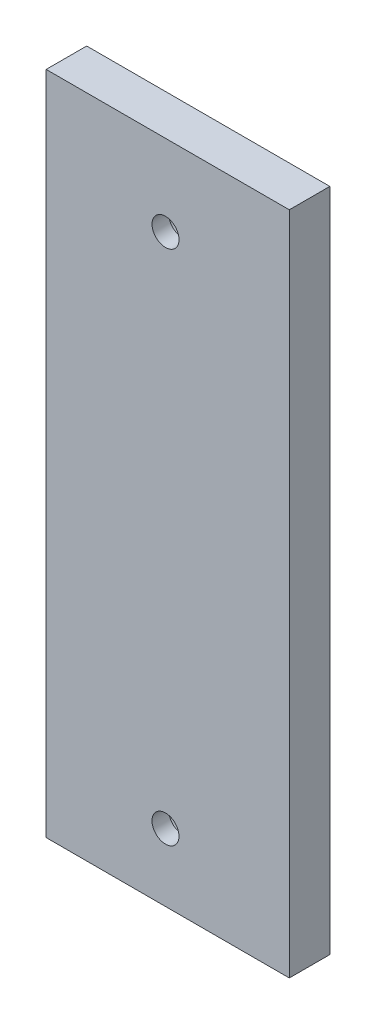
ISO-10303-21;
HEADER;
FILE_DESCRIPTION(('STEP AP214'),'2;1');
FILE_NAME('part.step','',(''),(''),'','','');
FILE_SCHEMA(('AUTOMOTIVE_DESIGN { 1 0 10303 214 1 1 1 1 }'));
ENDSEC;
DATA;
#1=APPLICATION_CONTEXT('core data for automotive mechanical design processes');
#2=APPLICATION_PROTOCOL_DEFINITION('international standard','automotive_design',2000,#1);
#3=PRODUCT_CONTEXT('',#1,'mechanical');
#4=PRODUCT('Part','Part','',(#3));
#5=PRODUCT_RELATED_PRODUCT_CATEGORY('part','',(#4));
#6=PRODUCT_DEFINITION_FORMATION('','',#4);
#7=PRODUCT_DEFINITION_CONTEXT('part definition',#1,'design');
#8=PRODUCT_DEFINITION('design','',#6,#7);
#9=PRODUCT_DEFINITION_SHAPE('','',#8);
#10=(LENGTH_UNIT() NAMED_UNIT(*) SI_UNIT(.MILLI.,.METRE.));
#11=(NAMED_UNIT(*) PLANE_ANGLE_UNIT() SI_UNIT($,.RADIAN.));
#12=(NAMED_UNIT(*) SI_UNIT($,.STERADIAN.) SOLID_ANGLE_UNIT());
#13=UNCERTAINTY_MEASURE_WITH_UNIT(LENGTH_MEASURE(1.E-05),#10,'distance_accuracy_value','');
#14=(GEOMETRIC_REPRESENTATION_CONTEXT(3) GLOBAL_UNCERTAINTY_ASSIGNED_CONTEXT((#13)) GLOBAL_UNIT_ASSIGNED_CONTEXT((#10,
#11,#12)) REPRESENTATION_CONTEXT('',''));
#15=CARTESIAN_POINT('',(0.,0.,0.));
#16=DIRECTION('',(0.,0.,1.));
#17=DIRECTION('',(1.,0.,0.));
#18=AXIS2_PLACEMENT_3D('',#15,#16,#17);
#19=CARTESIAN_POINT('',(0.,-76.5,-6.));
#20=DIRECTION('',(0.,0.,1.));
#21=DIRECTION('',(1.,0.,0.));
#22=AXIS2_PLACEMENT_3D('',#19,#20,#21);
#23=CYLINDRICAL_SURFACE('',#22,2.);
#24=CARTESIAN_POINT('',(0.,-76.5,6.));
#25=DIRECTION('',(0.,0.,1.));
#26=DIRECTION('',(1.,0.,0.));
#27=AXIS2_PLACEMENT_3D('',#24,#25,#26);
#28=CIRCLE('',#27,2.);
#29=CARTESIAN_POINT('',(2.,-76.5,6.));
#30=VERTEX_POINT('',#29);
#31=EDGE_CURVE('E173',#30,#30,#28,.T.);
#32=ORIENTED_EDGE('',*,*,#31,.T.);
#33=EDGE_LOOP('',(#32));
#34=FACE_BOUND('',#33,.T.);
#35=CARTESIAN_POINT('',(0.,-76.5,3.5));
#36=DIRECTION('',(0.,0.,-1.));
#37=DIRECTION('',(-1.,0.,0.));
#38=AXIS2_PLACEMENT_3D('',#35,#36,#37);
#39=CIRCLE('',#38,2.);
#40=CARTESIAN_POINT('',(-2.,-76.5,3.5));
#41=VERTEX_POINT('',#40);
#42=EDGE_CURVE('E270',#41,#41,#39,.F.);
#43=ORIENTED_EDGE('',*,*,#42,.F.);
#44=EDGE_LOOP('',(#43));
#45=FACE_BOUND('',#44,.T.);
#46=ADVANCED_FACE('F75',(#34,#45),#23,.F.);
#47=CARTESIAN_POINT('',(0.,0.,-6.));
#48=DIRECTION('',(0.,0.,1.));
#49=DIRECTION('',(1.,0.,0.));
#50=AXIS2_PLACEMENT_3D('',#47,#48,#49);
#51=CYLINDRICAL_SURFACE('',#50,2.);
#52=CARTESIAN_POINT('',(0.,0.,6.));
#53=DIRECTION('',(0.,0.,1.));
#54=DIRECTION('',(1.,0.,0.));
#55=AXIS2_PLACEMENT_3D('',#52,#53,#54);
#56=CIRCLE('',#55,2.);
#57=CARTESIAN_POINT('',(2.,0.,6.));
#58=VERTEX_POINT('',#57);
#59=EDGE_CURVE('E266',#58,#58,#56,.T.);
#60=ORIENTED_EDGE('',*,*,#59,.T.);
#61=EDGE_LOOP('',(#60));
#62=FACE_BOUND('',#61,.T.);
#63=CARTESIAN_POINT('',(0.,0.,3.5));
#64=DIRECTION('',(0.,0.,-1.));
#65=DIRECTION('',(-1.,0.,0.));
#66=AXIS2_PLACEMENT_3D('',#63,#64,#65);
#67=CIRCLE('',#66,2.);
#68=CARTESIAN_POINT('',(-2.,0.,3.5));
#69=VERTEX_POINT('',#68);
#70=EDGE_CURVE('E259',#69,#69,#67,.F.);
#71=ORIENTED_EDGE('',*,*,#70,.F.);
#72=EDGE_LOOP('',(#71));
#73=FACE_BOUND('',#72,.T.);
#74=ADVANCED_FACE('F326',(#62,#73),#51,.F.);
#75=CARTESIAN_POINT('',(-19.6697568376902,-86.5,4.));
#76=DIRECTION('',(0.,1.,0.));
#77=DIRECTION('',(0.,0.,1.));
#78=AXIS2_PLACEMENT_3D('',#75,#76,#77);
#79=PLANE('',#78);
#80=DIRECTION('',(1.,0.,0.));
#81=VECTOR('',#80,1.);
#82=CARTESIAN_POINT('',(-19.6697568376902,-86.5,0.));
#83=LINE('',#82,#81);
#84=CARTESIAN_POINT('',(-17.6697568376902,-86.5,0.));
#85=VERTEX_POINT('',#84);
#86=CARTESIAN_POINT('',(-10.8633723894514,-86.5,0.));
#87=VERTEX_POINT('',#86);
#88=EDGE_CURVE('E12',#85,#87,#83,.T.);
#89=ORIENTED_EDGE('',*,*,#88,.T.);
#90=DIRECTION('',(-0.34202013946712,0.,0.939692622190305));
#91=VECTOR('',#90,1.);
#92=CARTESIAN_POINT('',(-13.1790988618468,-86.5,6.362406273827));
#93=LINE('',#92,#91);
#94=CARTESIAN_POINT('',(-12.3920473538388,-86.5,4.2));
#95=VERTEX_POINT('',#94);
#96=EDGE_CURVE('E252',#87,#95,#93,.T.);
#97=ORIENTED_EDGE('',*,*,#96,.T.);
#98=DIRECTION('',(1.,0.,0.));
#99=VECTOR('',#98,1.);
#100=CARTESIAN_POINT('',(-19.6697568376902,-86.5,4.20000000000006));
#101=LINE('',#100,#99);
#102=CARTESIAN_POINT('',(-11.7757358965809,-86.5,4.2));
#103=VERTEX_POINT('',#102);
#104=EDGE_CURVE('E243',#95,#103,#101,.T.);
#105=ORIENTED_EDGE('',*,*,#104,.T.);
#106=DIRECTION('',(0.707106781186548,0.,-0.707106781186548));
#107=VECTOR('',#106,1.);
#108=CARTESIAN_POINT('',(-15.6227463671356,-86.5,8.04701047055465));
#109=LINE('',#108,#107);
#110=CARTESIAN_POINT('',(-7.57573589658091,-86.5,0.));
#111=VERTEX_POINT('',#110);
#112=EDGE_CURVE('E246',#103,#111,#109,.T.);
#113=ORIENTED_EDGE('',*,*,#112,.T.);
#114=CARTESIAN_POINT('',(7.57573704490984,-86.5,0.));
#115=VERTEX_POINT('',#114);
#116=EDGE_CURVE('E83',#111,#115,#83,.T.);
#117=ORIENTED_EDGE('',*,*,#116,.T.);
#118=DIRECTION('',(0.707106831438041,0.,0.707106730935051));
#119=VECTOR('',#118,1.);
#120=CARTESIAN_POINT('',(-4.04701183262788,-86.5,-11.6227472255653));
#121=LINE('',#120,#119);
#122=CARTESIAN_POINT('',(11.7757376418672,-86.5,4.2));
#123=VERTEX_POINT('',#122);
#124=EDGE_CURVE('E237',#115,#123,#121,.T.);
#125=ORIENTED_EDGE('',*,*,#124,.T.);
#126=DIRECTION('',(1.,0.,0.));
#127=VECTOR('',#126,1.);
#128=CARTESIAN_POINT('',(-19.6697568376902,-86.5,4.20000000000013));
#129=LINE('',#128,#127);
#130=CARTESIAN_POINT('',(12.3920482223146,-86.5,4.2));
#131=VERTEX_POINT('',#130);
#132=EDGE_CURVE('E214',#123,#131,#129,.T.);
#133=ORIENTED_EDGE('',*,*,#132,.T.);
#134=DIRECTION('',(-0.342020209845369,0.,-0.939692596574715));
#135=VECTOR('',#134,1.);
#136=CARTESIAN_POINT('',(8.57724926290699,-86.5,-6.28107169221646));
#137=LINE('',#136,#135);
#138=CARTESIAN_POINT('',(10.8633729016973,-86.5,0.));
#139=VERTEX_POINT('',#138);
#140=EDGE_CURVE('E235',#131,#139,#137,.T.);
#141=ORIENTED_EDGE('',*,*,#140,.T.);
#142=CARTESIAN_POINT('',(18.3302431623098,-86.5,0.));
#143=VERTEX_POINT('',#142);
#144=EDGE_CURVE('E84',#139,#143,#83,.T.);
#145=ORIENTED_EDGE('',*,*,#144,.T.);
#146=DIRECTION('',(0.,0.,1.));
#147=VECTOR('',#146,1.);
#148=CARTESIAN_POINT('',(18.3302431623098,-86.5,-6.));
#149=LINE('',#148,#147);
#150=CARTESIAN_POINT('',(18.3302431623098,-86.5,6.));
#151=VERTEX_POINT('',#150);
#152=EDGE_CURVE('E283',#143,#151,#149,.T.);
#153=ORIENTED_EDGE('',*,*,#152,.T.);
#154=DIRECTION('',(1.,0.,0.));
#155=VECTOR('',#154,1.);
#156=CARTESIAN_POINT('',(-17.6697568376902,-86.5,6.));
#157=LINE('',#156,#155);
#158=CARTESIAN_POINT('',(-17.6697568376902,-86.5,6.));
#159=VERTEX_POINT('',#158);
#160=EDGE_CURVE('E172',#159,#151,#157,.T.);
#161=ORIENTED_EDGE('',*,*,#160,.F.);
#162=DIRECTION('',(0.,0.,1.));
#163=VECTOR('',#162,1.);
#164=CARTESIAN_POINT('',(-17.6697568376902,-86.5,-6.));
#165=LINE('',#164,#163);
#166=EDGE_CURVE('E168',#85,#159,#165,.T.);
#167=ORIENTED_EDGE('',*,*,#166,.F.);
#168=EDGE_LOOP('',(#89,#97,#105,#113,#117,#125,#133,#141,#145,#153,#161,#167));
#169=FACE_BOUND('',#168,.T.);
#170=ADVANCED_FACE('F77',(#169),#79,.F.);
#171=CARTESIAN_POINT('',(0.,0.,0.));
#172=DIRECTION('',(0.,0.,1.));
#173=DIRECTION('',(1.,0.,0.));
#174=AXIS2_PLACEMENT_3D('',#171,#172,#173);
#175=PLANE('',#174);
#176=ORIENTED_EDGE('',*,*,#144,.F.);
#177=DIRECTION('',(0.,1.,0.));
#178=VECTOR('',#177,1.);
#179=CARTESIAN_POINT('',(10.8633729016973,0.,0.));
#180=LINE('',#179,#178);
#181=CARTESIAN_POINT('',(10.8633729016973,10.,0.));
#182=VERTEX_POINT('',#181);
#183=EDGE_CURVE('E232',#139,#182,#180,.T.);
#184=ORIENTED_EDGE('',*,*,#183,.T.);
#185=DIRECTION('',(-1.,0.,0.));
#186=VECTOR('',#185,1.);
#187=CARTESIAN_POINT('',(-17.6697568376902,10.,0.));
#188=LINE('',#187,#186);
#189=CARTESIAN_POINT('',(7.57573704490984,10.,0.));
#190=VERTEX_POINT('',#189);
#191=EDGE_CURVE('E190',#182,#190,#188,.T.);
#192=ORIENTED_EDGE('',*,*,#191,.T.);
#193=DIRECTION('',(0.,-1.,0.));
#194=VECTOR('',#193,1.);
#195=CARTESIAN_POINT('',(7.57573704490984,0.,0.));
#196=LINE('',#195,#194);
#197=EDGE_CURVE('E240',#190,#115,#196,.T.);
#198=ORIENTED_EDGE('',*,*,#197,.T.);
#199=ORIENTED_EDGE('',*,*,#116,.F.);
#200=DIRECTION('',(0.,1.,0.));
#201=VECTOR('',#200,1.);
#202=CARTESIAN_POINT('',(-7.57573589658091,0.,0.));
#203=LINE('',#202,#201);
#204=CARTESIAN_POINT('',(-7.57573589658092,10.,0.));
#205=VERTEX_POINT('',#204);
#206=EDGE_CURVE('E249',#111,#205,#203,.T.);
#207=ORIENTED_EDGE('',*,*,#206,.T.);
#208=CARTESIAN_POINT('',(-10.8633723894514,10.,0.));
#209=VERTEX_POINT('',#208);
#210=EDGE_CURVE('E193',#205,#209,#188,.T.);
#211=ORIENTED_EDGE('',*,*,#210,.T.);
#212=DIRECTION('',(0.,-1.,0.));
#213=VECTOR('',#212,1.);
#214=CARTESIAN_POINT('',(-10.8633723894514,0.,0.));
#215=LINE('',#214,#213);
#216=EDGE_CURVE('E255',#209,#87,#215,.T.);
#217=ORIENTED_EDGE('',*,*,#216,.T.);
#218=ORIENTED_EDGE('',*,*,#88,.F.);
#219=DIRECTION('',(0.,1.,0.));
#220=VECTOR('',#219,1.);
#221=CARTESIAN_POINT('',(-17.6697568376902,0.,0.));
#222=LINE('',#221,#220);
#223=CARTESIAN_POINT('',(-17.6697568376902,12.,0.));
#224=VERTEX_POINT('',#223);
#225=EDGE_CURVE('E91',#85,#224,#222,.T.);
#226=ORIENTED_EDGE('',*,*,#225,.T.);
#227=DIRECTION('',(-1.,0.,0.));
#228=VECTOR('',#227,1.);
#229=CARTESIAN_POINT('',(-17.6697568376902,12.,0.));
#230=LINE('',#229,#228);
#231=CARTESIAN_POINT('',(18.3302431623098,12.,0.));
#232=VERTEX_POINT('',#231);
#233=EDGE_CURVE('E189',#232,#224,#230,.T.);
#234=ORIENTED_EDGE('',*,*,#233,.F.);
#235=DIRECTION('',(0.,-1.,0.));
#236=VECTOR('',#235,1.);
#237=CARTESIAN_POINT('',(18.3302431623098,0.,0.));
#238=LINE('',#237,#236);
#239=EDGE_CURVE('E285',#232,#143,#238,.T.);
#240=ORIENTED_EDGE('',*,*,#239,.T.);
#241=EDGE_LOOP('',(#176,#184,#192,#198,#199,#207,#211,#217,#218,#226,#234,#240));
#242=FACE_BOUND('',#241,.T.);
#243=CARTESIAN_POINT('',(0.,0.,0.));
#244=DIRECTION('',(0.,0.,-1.));
#245=DIRECTION('',(-1.,0.,0.));
#246=AXIS2_PLACEMENT_3D('',#243,#244,#245);
#247=CIRCLE('',#246,4.25);
#248=CARTESIAN_POINT('',(-4.25,0.,0.));
#249=VERTEX_POINT('',#248);
#250=EDGE_CURVE('E263',#249,#249,#247,.T.);
#251=ORIENTED_EDGE('',*,*,#250,.F.);
#252=EDGE_LOOP('',(#251));
#253=FACE_BOUND('',#252,.T.);
#254=CARTESIAN_POINT('',(0.,-76.5,0.));
#255=DIRECTION('',(0.,0.,-1.));
#256=DIRECTION('',(-1.,0.,0.));
#257=AXIS2_PLACEMENT_3D('',#254,#255,#256);
#258=CIRCLE('',#257,4.25);
#259=CARTESIAN_POINT('',(-4.25,-76.5,0.));
#260=VERTEX_POINT('',#259);
#261=EDGE_CURVE('E258',#260,#260,#258,.T.);
#262=ORIENTED_EDGE('',*,*,#261,.F.);
#263=EDGE_LOOP('',(#262));
#264=FACE_BOUND('',#263,.T.);
#265=ADVANCED_FACE('F292',(#242,#253,#264),#175,.F.);
#266=CARTESIAN_POINT('',(18.3302431623098,10.,-6.));
#267=DIRECTION('',(-1.,0.,0.));
#268=DIRECTION('',(0.,-1.,0.));
#269=AXIS2_PLACEMENT_3D('',#266,#267,#268);
#270=PLANE('',#269);
#271=ORIENTED_EDGE('',*,*,#239,.F.);
#272=DIRECTION('',(0.,0.,-1.));
#273=VECTOR('',#272,1.);
#274=CARTESIAN_POINT('',(18.3302431623098,12.,0.));
#275=LINE('',#274,#273);
#276=CARTESIAN_POINT('',(18.3302431623098,12.,6.));
#277=VERTEX_POINT('',#276);
#278=EDGE_CURVE('E184',#277,#232,#275,.T.);
#279=ORIENTED_EDGE('',*,*,#278,.F.);
#280=DIRECTION('',(0.,1.,0.));
#281=VECTOR('',#280,1.);
#282=CARTESIAN_POINT('',(18.3302431623098,10.,6.));
#283=LINE('',#282,#281);
#284=EDGE_CURVE('E180',#151,#277,#283,.T.);
#285=ORIENTED_EDGE('',*,*,#284,.F.);
#286=ORIENTED_EDGE('',*,*,#152,.F.);
#287=EDGE_LOOP('',(#271,#279,#285,#286));
#288=FACE_BOUND('',#287,.T.);
#289=ADVANCED_FACE('F303',(#288),#270,.F.);
#290=CARTESIAN_POINT('',(-17.6697568376902,-86.5,-6.));
#291=DIRECTION('',(1.,0.,0.));
#292=DIRECTION('',(0.,0.,-1.));
#293=AXIS2_PLACEMENT_3D('',#290,#291,#292);
#294=PLANE('',#293);
#295=ORIENTED_EDGE('',*,*,#166,.T.);
#296=DIRECTION('',(0.,-1.,0.));
#297=VECTOR('',#296,1.);
#298=CARTESIAN_POINT('',(-17.6697568376902,10.,6.));
#299=LINE('',#298,#297);
#300=CARTESIAN_POINT('',(-17.6697568376902,12.,6.));
#301=VERTEX_POINT('',#300);
#302=EDGE_CURVE('E163',#301,#159,#299,.T.);
#303=ORIENTED_EDGE('',*,*,#302,.F.);
#304=DIRECTION('',(0.,0.,1.));
#305=VECTOR('',#304,1.);
#306=CARTESIAN_POINT('',(-17.6697568376902,12.,0.));
#307=LINE('',#306,#305);
#308=EDGE_CURVE('E167',#224,#301,#307,.T.);
#309=ORIENTED_EDGE('',*,*,#308,.F.);
#310=ORIENTED_EDGE('',*,*,#225,.F.);
#311=EDGE_LOOP('',(#295,#303,#309,#310));
#312=FACE_BOUND('',#311,.T.);
#313=ADVANCED_FACE('F165',(#312),#294,.F.);
#314=CARTESIAN_POINT('',(0.,0.,6.));
#315=DIRECTION('',(0.,0.,1.));
#316=DIRECTION('',(1.,0.,0.));
#317=AXIS2_PLACEMENT_3D('',#314,#315,#316);
#318=PLANE('',#317);
#319=ORIENTED_EDGE('',*,*,#31,.F.);
#320=EDGE_LOOP('',(#319));
#321=FACE_BOUND('',#320,.T.);
#322=ORIENTED_EDGE('',*,*,#302,.T.);
#323=ORIENTED_EDGE('',*,*,#160,.T.);
#324=ORIENTED_EDGE('',*,*,#284,.T.);
#325=DIRECTION('',(1.,0.,0.));
#326=VECTOR('',#325,1.);
#327=CARTESIAN_POINT('',(-17.6697568376902,12.,6.));
#328=LINE('',#327,#326);
#329=EDGE_CURVE('E176',#301,#277,#328,.T.);
#330=ORIENTED_EDGE('',*,*,#329,.F.);
#331=EDGE_LOOP('',(#322,#323,#324,#330));
#332=FACE_BOUND('',#331,.T.);
#333=ORIENTED_EDGE('',*,*,#59,.F.);
#334=EDGE_LOOP('',(#333));
#335=FACE_BOUND('',#334,.T.);
#336=ADVANCED_FACE('F177',(#321,#332,#335),#318,.T.);
#337=CARTESIAN_POINT('',(0.,0.,3.5));
#338=DIRECTION('',(0.,0.,-1.));
#339=DIRECTION('',(-1.,0.,0.));
#340=AXIS2_PLACEMENT_3D('',#337,#338,#339);
#341=CYLINDRICAL_SURFACE('',#340,4.25);
#342=CARTESIAN_POINT('',(0.,0.,3.5));
#343=DIRECTION('',(0.,0.,-1.));
#344=DIRECTION('',(-1.,0.,0.));
#345=AXIS2_PLACEMENT_3D('',#342,#343,#344);
#346=CIRCLE('',#345,4.25);
#347=CARTESIAN_POINT('',(-4.25,0.,3.5));
#348=VERTEX_POINT('',#347);
#349=EDGE_CURVE('E262',#348,#348,#346,.T.);
#350=ORIENTED_EDGE('',*,*,#349,.F.);
#351=EDGE_LOOP('',(#350));
#352=FACE_BOUND('',#351,.T.);
#353=ORIENTED_EDGE('',*,*,#250,.T.);
#354=EDGE_LOOP('',(#353));
#355=FACE_BOUND('',#354,.T.);
#356=ADVANCED_FACE('F350',(#352,#355),#341,.F.);
#357=CARTESIAN_POINT('',(0.,0.,3.5));
#358=DIRECTION('',(0.,0.,-1.));
#359=DIRECTION('',(-1.,0.,0.));
#360=AXIS2_PLACEMENT_3D('',#357,#358,#359);
#361=PLANE('',#360);
#362=ORIENTED_EDGE('',*,*,#70,.T.);
#363=EDGE_LOOP('',(#362));
#364=FACE_BOUND('',#363,.T.);
#365=ORIENTED_EDGE('',*,*,#349,.T.);
#366=EDGE_LOOP('',(#365));
#367=FACE_BOUND('',#366,.T.);
#368=ADVANCED_FACE('F354',(#364,#367),#361,.T.);
#369=CARTESIAN_POINT('',(0.,-76.5,3.5));
#370=DIRECTION('',(0.,0.,-1.));
#371=DIRECTION('',(-1.,0.,0.));
#372=AXIS2_PLACEMENT_3D('',#369,#370,#371);
#373=CYLINDRICAL_SURFACE('',#372,4.25);
#374=CARTESIAN_POINT('',(0.,-76.5,3.5));
#375=DIRECTION('',(0.,0.,-1.));
#376=DIRECTION('',(-1.,0.,0.));
#377=AXIS2_PLACEMENT_3D('',#374,#375,#376);
#378=CIRCLE('',#377,4.25);
#379=CARTESIAN_POINT('',(-4.25,-76.5,3.5));
#380=VERTEX_POINT('',#379);
#381=EDGE_CURVE('E269',#380,#380,#378,.T.);
#382=ORIENTED_EDGE('',*,*,#381,.F.);
#383=EDGE_LOOP('',(#382));
#384=FACE_BOUND('',#383,.T.);
#385=ORIENTED_EDGE('',*,*,#261,.T.);
#386=EDGE_LOOP('',(#385));
#387=FACE_BOUND('',#386,.T.);
#388=ADVANCED_FACE('F362',(#384,#387),#373,.F.);
#389=CARTESIAN_POINT('',(0.,0.,3.5));
#390=DIRECTION('',(0.,0.,-1.));
#391=DIRECTION('',(-1.,0.,0.));
#392=AXIS2_PLACEMENT_3D('',#389,#390,#391);
#393=PLANE('',#392);
#394=ORIENTED_EDGE('',*,*,#42,.T.);
#395=EDGE_LOOP('',(#394));
#396=FACE_BOUND('',#395,.T.);
#397=ORIENTED_EDGE('',*,*,#381,.T.);
#398=EDGE_LOOP('',(#397));
#399=FACE_BOUND('',#398,.T.);
#400=ADVANCED_FACE('F370',(#396,#399),#393,.T.);
#401=CARTESIAN_POINT('',(7.3757370164833,-112.,-0.2));
#402=DIRECTION('',(-0.707106730935051,0.,0.707106831438041));
#403=DIRECTION('',(0.707106831438041,0.,0.707106730935051));
#404=AXIS2_PLACEMENT_3D('',#401,#402,#403);
#405=PLANE('',#404);
#406=DIRECTION('',(0.707106831438041,0.,0.707106730935051));
#407=VECTOR('',#406,1.);
#408=CARTESIAN_POINT('',(7.3757370164833,10.,-0.2));
#409=LINE('',#408,#407);
#410=CARTESIAN_POINT('',(11.7757376418672,10.,4.2));
#411=VERTEX_POINT('',#410);
#412=EDGE_CURVE('E197',#190,#411,#409,.T.);
#413=ORIENTED_EDGE('',*,*,#412,.T.);
#414=DIRECTION('',(0.,1.,0.));
#415=VECTOR('',#414,1.);
#416=CARTESIAN_POINT('',(11.7757376418672,-112.,4.2));
#417=LINE('',#416,#415);
#418=EDGE_CURVE('E225',#123,#411,#417,.T.);
#419=ORIENTED_EDGE('',*,*,#418,.F.);
#420=ORIENTED_EDGE('',*,*,#124,.F.);
#421=ORIENTED_EDGE('',*,*,#197,.F.);
#422=EDGE_LOOP('',(#413,#419,#420,#421));
#423=FACE_BOUND('',#422,.T.);
#424=ADVANCED_FACE('F296',(#423),#405,.F.);
#425=CARTESIAN_POINT('',(12.3920482223146,-112.,4.2));
#426=DIRECTION('',(0.939692596574715,0.,-0.342020209845369));
#427=DIRECTION('',(-0.342020209845369,0.,-0.939692596574715));
#428=AXIS2_PLACEMENT_3D('',#425,#426,#427);
#429=PLANE('',#428);
#430=DIRECTION('',(0.,1.,0.));
#431=VECTOR('',#430,1.);
#432=CARTESIAN_POINT('',(12.3920482223146,-112.,4.2));
#433=LINE('',#432,#431);
#434=CARTESIAN_POINT('',(12.3920482223146,10.,4.2));
#435=VERTEX_POINT('',#434);
#436=EDGE_CURVE('E204',#131,#435,#433,.T.);
#437=ORIENTED_EDGE('',*,*,#436,.T.);
#438=DIRECTION('',(-0.342020209845369,0.,-0.939692596574715));
#439=VECTOR('',#438,1.);
#440=CARTESIAN_POINT('',(12.3920482223146,10.,4.2));
#441=LINE('',#440,#439);
#442=EDGE_CURVE('E222',#435,#182,#441,.T.);
#443=ORIENTED_EDGE('',*,*,#442,.T.);
#444=ORIENTED_EDGE('',*,*,#183,.F.);
#445=ORIENTED_EDGE('',*,*,#140,.F.);
#446=EDGE_LOOP('',(#437,#443,#444,#445));
#447=FACE_BOUND('',#446,.T.);
#448=ADVANCED_FACE('F385',(#447),#429,.F.);
#449=CARTESIAN_POINT('',(11.7757376418672,-112.,4.2));
#450=DIRECTION('',(0.,0.,1.));
#451=DIRECTION('',(1.,0.,0.));
#452=AXIS2_PLACEMENT_3D('',#449,#450,#451);
#453=PLANE('',#452);
#454=ORIENTED_EDGE('',*,*,#418,.T.);
#455=DIRECTION('',(1.,0.,0.));
#456=VECTOR('',#455,1.);
#457=CARTESIAN_POINT('',(11.7757376418672,10.,4.2));
#458=LINE('',#457,#456);
#459=EDGE_CURVE('E219',#411,#435,#458,.T.);
#460=ORIENTED_EDGE('',*,*,#459,.T.);
#461=ORIENTED_EDGE('',*,*,#436,.F.);
#462=ORIENTED_EDGE('',*,*,#132,.F.);
#463=EDGE_LOOP('',(#454,#460,#461,#462));
#464=FACE_BOUND('',#463,.T.);
#465=ADVANCED_FACE('F299',(#464),#453,.F.);
#466=CARTESIAN_POINT('',(-10.7905783435282,-112.,-0.2));
#467=DIRECTION('',(-0.939692622190305,0.,-0.34202013946712));
#468=DIRECTION('',(-0.34202013946712,0.,0.939692622190305));
#469=AXIS2_PLACEMENT_3D('',#466,#467,#468);
#470=PLANE('',#469);
#471=DIRECTION('',(-0.34202013946712,0.,0.939692622190305));
#472=VECTOR('',#471,1.);
#473=CARTESIAN_POINT('',(-10.7905783435282,10.,-0.2));
#474=LINE('',#473,#472);
#475=CARTESIAN_POINT('',(-12.3920473538388,10.,4.2));
#476=VERTEX_POINT('',#475);
#477=EDGE_CURVE('E200',#209,#476,#474,.T.);
#478=ORIENTED_EDGE('',*,*,#477,.T.);
#479=DIRECTION('',(0.,1.,0.));
#480=VECTOR('',#479,1.);
#481=CARTESIAN_POINT('',(-12.3920473538388,-112.,4.2));
#482=LINE('',#481,#480);
#483=EDGE_CURVE('E210',#95,#476,#482,.T.);
#484=ORIENTED_EDGE('',*,*,#483,.F.);
#485=ORIENTED_EDGE('',*,*,#96,.F.);
#486=ORIENTED_EDGE('',*,*,#216,.F.);
#487=EDGE_LOOP('',(#478,#484,#485,#486));
#488=FACE_BOUND('',#487,.T.);
#489=ADVANCED_FACE('F306',(#488),#470,.F.);
#490=CARTESIAN_POINT('',(-11.7757358965809,-112.,4.2));
#491=DIRECTION('',(0.707106781186548,0.,0.707106781186548));
#492=DIRECTION('',(0.707106781186548,0.,-0.707106781186548));
#493=AXIS2_PLACEMENT_3D('',#490,#491,#492);
#494=PLANE('',#493);
#495=ORIENTED_EDGE('',*,*,#112,.F.);
#496=DIRECTION('',(0.,1.,0.));
#497=VECTOR('',#496,1.);
#498=CARTESIAN_POINT('',(-11.7757358965809,-112.,4.2));
#499=LINE('',#498,#497);
#500=CARTESIAN_POINT('',(-11.7757358965809,10.,4.2));
#501=VERTEX_POINT('',#500);
#502=EDGE_CURVE('E211',#103,#501,#499,.T.);
#503=ORIENTED_EDGE('',*,*,#502,.T.);
#504=DIRECTION('',(0.707106781186547,0.,-0.707106781186547));
#505=VECTOR('',#504,1.);
#506=CARTESIAN_POINT('',(-11.7757358965809,10.,4.2));
#507=LINE('',#506,#505);
#508=EDGE_CURVE('E207',#501,#205,#507,.T.);
#509=ORIENTED_EDGE('',*,*,#508,.T.);
#510=ORIENTED_EDGE('',*,*,#206,.F.);
#511=EDGE_LOOP('',(#495,#503,#509,#510));
#512=FACE_BOUND('',#511,.T.);
#513=ADVANCED_FACE('F312',(#512),#494,.F.);
#514=CARTESIAN_POINT('',(-12.3920473538388,-112.,4.2));
#515=DIRECTION('',(0.,0.,1.));
#516=DIRECTION('',(1.,0.,0.));
#517=AXIS2_PLACEMENT_3D('',#514,#515,#516);
#518=PLANE('',#517);
#519=ORIENTED_EDGE('',*,*,#483,.T.);
#520=DIRECTION('',(1.,0.,0.));
#521=VECTOR('',#520,1.);
#522=CARTESIAN_POINT('',(-12.3920473538388,10.,4.2));
#523=LINE('',#522,#521);
#524=EDGE_CURVE('E203',#476,#501,#523,.T.);
#525=ORIENTED_EDGE('',*,*,#524,.T.);
#526=ORIENTED_EDGE('',*,*,#502,.F.);
#527=ORIENTED_EDGE('',*,*,#104,.F.);
#528=EDGE_LOOP('',(#519,#525,#526,#527));
#529=FACE_BOUND('',#528,.T.);
#530=ADVANCED_FACE('F310',(#529),#518,.F.);
#531=CARTESIAN_POINT('',(0.,10.,0.));
#532=DIRECTION('',(0.,1.,0.));
#533=DIRECTION('',(0.,0.,1.));
#534=AXIS2_PLACEMENT_3D('',#531,#532,#533);
#535=PLANE('',#534);
#536=ORIENTED_EDGE('',*,*,#442,.F.);
#537=ORIENTED_EDGE('',*,*,#459,.F.);
#538=ORIENTED_EDGE('',*,*,#412,.F.);
#539=ORIENTED_EDGE('',*,*,#191,.F.);
#540=EDGE_LOOP('',(#536,#537,#538,#539));
#541=FACE_BOUND('',#540,.T.);
#542=ADVANCED_FACE('F317',(#541),#535,.F.);
#543=CARTESIAN_POINT('',(0.,12.,0.));
#544=DIRECTION('',(0.,1.,0.));
#545=DIRECTION('',(0.,0.,1.));
#546=AXIS2_PLACEMENT_3D('',#543,#544,#545);
#547=PLANE('',#546);
#548=ORIENTED_EDGE('',*,*,#308,.T.);
#549=ORIENTED_EDGE('',*,*,#329,.T.);
#550=ORIENTED_EDGE('',*,*,#278,.T.);
#551=ORIENTED_EDGE('',*,*,#233,.T.);
#552=EDGE_LOOP('',(#548,#549,#550,#551));
#553=FACE_BOUND('',#552,.T.);
#554=ADVANCED_FACE('F187',(#553),#547,.T.);
#555=ORIENTED_EDGE('',*,*,#477,.F.);
#556=ORIENTED_EDGE('',*,*,#210,.F.);
#557=ORIENTED_EDGE('',*,*,#508,.F.);
#558=ORIENTED_EDGE('',*,*,#524,.F.);
#559=EDGE_LOOP('',(#555,#556,#557,#558));
#560=FACE_BOUND('',#559,.T.);
#561=ADVANCED_FACE('F314',(#560),#535,.F.);
#562=CLOSED_SHELL('',(#46,#74,#170,#265,#289,#313,#336,#356,#368,#388,#400,#424,#448,#465,#489,
#513,#530,#542,#554,#561));
#563=MANIFOLD_SOLID_BREP('B2',#562);
#564=ADVANCED_BREP_SHAPE_REPRESENTATION('',(#18,#563),#14);
#565=SHAPE_DEFINITION_REPRESENTATION(#9,#564);
ENDSEC;
END-ISO-10303-21;
